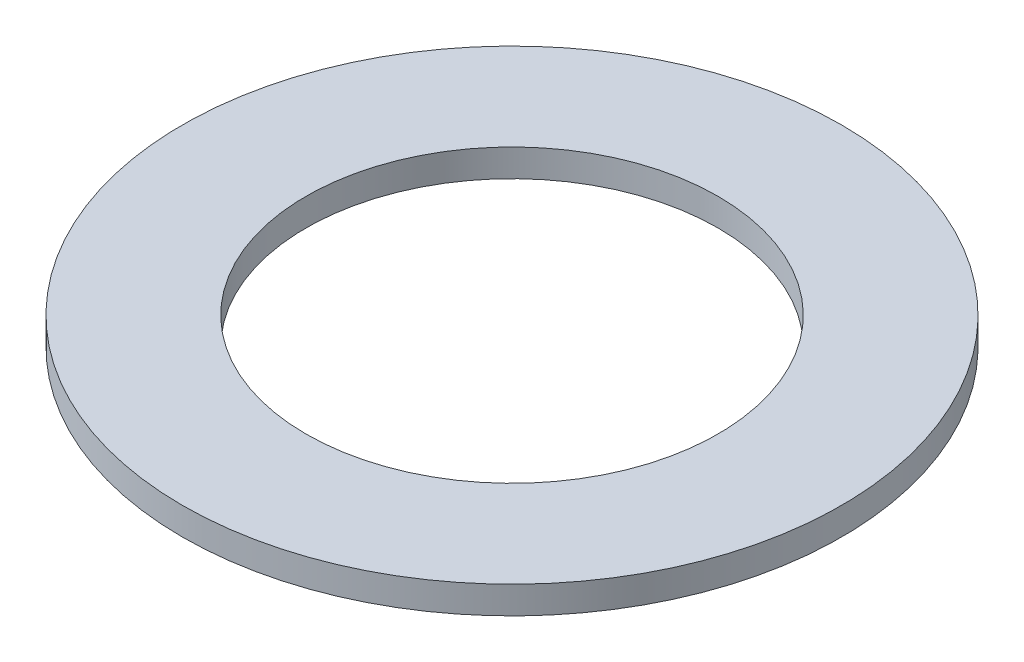
ISO-10303-21;
HEADER;
FILE_DESCRIPTION(('STEP AP214'),'2;1');
FILE_NAME('part.step','',(''),(''),'','','');
FILE_SCHEMA(('AUTOMOTIVE_DESIGN { 1 0 10303 214 1 1 1 1 }'));
ENDSEC;
DATA;
#1=APPLICATION_CONTEXT('core data for automotive mechanical design processes');
#2=APPLICATION_PROTOCOL_DEFINITION('international standard','automotive_design',2000,#1);
#3=PRODUCT_CONTEXT('',#1,'mechanical');
#4=PRODUCT('Part','Part','',(#3));
#5=PRODUCT_RELATED_PRODUCT_CATEGORY('part','',(#4));
#6=PRODUCT_DEFINITION_FORMATION('','',#4);
#7=PRODUCT_DEFINITION_CONTEXT('part definition',#1,'design');
#8=PRODUCT_DEFINITION('design','',#6,#7);
#9=PRODUCT_DEFINITION_SHAPE('','',#8);
#10=(LENGTH_UNIT() NAMED_UNIT(*) SI_UNIT(.MILLI.,.METRE.));
#11=(NAMED_UNIT(*) PLANE_ANGLE_UNIT() SI_UNIT($,.RADIAN.));
#12=(NAMED_UNIT(*) SI_UNIT($,.STERADIAN.) SOLID_ANGLE_UNIT());
#13=UNCERTAINTY_MEASURE_WITH_UNIT(LENGTH_MEASURE(1.E-05),#10,'distance_accuracy_value','');
#14=(GEOMETRIC_REPRESENTATION_CONTEXT(3) GLOBAL_UNCERTAINTY_ASSIGNED_CONTEXT((#13)) GLOBAL_UNIT_ASSIGNED_CONTEXT((#10,
#11,#12)) REPRESENTATION_CONTEXT('',''));
#15=CARTESIAN_POINT('',(0.,0.,0.));
#16=DIRECTION('',(0.,0.,1.));
#17=DIRECTION('',(1.,0.,0.));
#18=AXIS2_PLACEMENT_3D('',#15,#16,#17);
#19=CARTESIAN_POINT('',(0.,1.,0.));
#20=DIRECTION('',(0.,1.,0.));
#21=DIRECTION('',(0.,0.,1.));
#22=AXIS2_PLACEMENT_3D('',#19,#20,#21);
#23=PLANE('',#22);
#24=CARTESIAN_POINT('',(0.,1.,0.));
#25=DIRECTION('',(0.,1.,0.));
#26=DIRECTION('',(0.,0.,1.));
#27=AXIS2_PLACEMENT_3D('',#24,#25,#26);
#28=CIRCLE('',#27,12.);
#29=CARTESIAN_POINT('',(0.,1.,12.));
#30=VERTEX_POINT('',#29);
#31=EDGE_CURVE('E10',#30,#30,#28,.T.);
#32=ORIENTED_EDGE('',*,*,#31,.T.);
#33=EDGE_LOOP('',(#32));
#34=FACE_BOUND('',#33,.T.);
#35=CARTESIAN_POINT('',(0.,1.,0.));
#36=DIRECTION('',(0.,1.,0.));
#37=DIRECTION('',(0.,0.,1.));
#38=AXIS2_PLACEMENT_3D('',#35,#36,#37);
#39=CIRCLE('',#38,7.5);
#40=CARTESIAN_POINT('',(0.,1.,7.5));
#41=VERTEX_POINT('',#40);
#42=EDGE_CURVE('E56',#41,#41,#39,.T.);
#43=ORIENTED_EDGE('',*,*,#42,.F.);
#44=EDGE_LOOP('',(#43));
#45=FACE_BOUND('',#44,.T.);
#46=ADVANCED_FACE('F43',(#34,#45),#23,.T.);
#47=CARTESIAN_POINT('',(0.,0.,0.));
#48=DIRECTION('',(0.,1.,0.));
#49=DIRECTION('',(0.,0.,1.));
#50=AXIS2_PLACEMENT_3D('',#47,#48,#49);
#51=PLANE('',#50);
#52=CARTESIAN_POINT('',(0.,0.,0.));
#53=DIRECTION('',(0.,1.,0.));
#54=DIRECTION('',(0.,0.,1.));
#55=AXIS2_PLACEMENT_3D('',#52,#53,#54);
#56=CIRCLE('',#55,12.);
#57=CARTESIAN_POINT('',(0.,0.,12.));
#58=VERTEX_POINT('',#57);
#59=EDGE_CURVE('E47',#58,#58,#56,.T.);
#60=ORIENTED_EDGE('',*,*,#59,.F.);
#61=EDGE_LOOP('',(#60));
#62=FACE_BOUND('',#61,.T.);
#63=CARTESIAN_POINT('',(0.,0.,0.));
#64=DIRECTION('',(0.,1.,0.));
#65=DIRECTION('',(0.,0.,1.));
#66=AXIS2_PLACEMENT_3D('',#63,#64,#65);
#67=CIRCLE('',#66,7.5);
#68=CARTESIAN_POINT('',(0.,0.,7.5));
#69=VERTEX_POINT('',#68);
#70=EDGE_CURVE('E58',#69,#69,#67,.T.);
#71=ORIENTED_EDGE('',*,*,#70,.T.);
#72=EDGE_LOOP('',(#71));
#73=FACE_BOUND('',#72,.T.);
#74=ADVANCED_FACE('F70',(#62,#73),#51,.F.);
#75=CARTESIAN_POINT('',(0.,1.,0.));
#76=DIRECTION('',(0.,-1.,0.));
#77=DIRECTION('',(0.,0.,-1.));
#78=AXIS2_PLACEMENT_3D('',#75,#76,#77);
#79=CYLINDRICAL_SURFACE('',#78,12.);
#80=ORIENTED_EDGE('',*,*,#31,.F.);
#81=EDGE_LOOP('',(#80));
#82=FACE_BOUND('',#81,.T.);
#83=ORIENTED_EDGE('',*,*,#59,.T.);
#84=EDGE_LOOP('',(#83));
#85=FACE_BOUND('',#84,.T.);
#86=ADVANCED_FACE('F45',(#82,#85),#79,.T.);
#87=CARTESIAN_POINT('',(0.,1.,0.));
#88=DIRECTION('',(0.,-1.,0.));
#89=DIRECTION('',(0.,0.,-1.));
#90=AXIS2_PLACEMENT_3D('',#87,#88,#89);
#91=CYLINDRICAL_SURFACE('',#90,7.5);
#92=ORIENTED_EDGE('',*,*,#42,.T.);
#93=EDGE_LOOP('',(#92));
#94=FACE_BOUND('',#93,.T.);
#95=ORIENTED_EDGE('',*,*,#70,.F.);
#96=EDGE_LOOP('',(#95));
#97=FACE_BOUND('',#96,.T.);
#98=ADVANCED_FACE('F66',(#94,#97),#91,.F.);
#99=CLOSED_SHELL('',(#46,#74,#86,#98));
#100=MANIFOLD_SOLID_BREP('B2',#99);
#101=ADVANCED_BREP_SHAPE_REPRESENTATION('',(#18,#100),#14);
#102=SHAPE_DEFINITION_REPRESENTATION(#9,#101);
ENDSEC;
END-ISO-10303-21;
